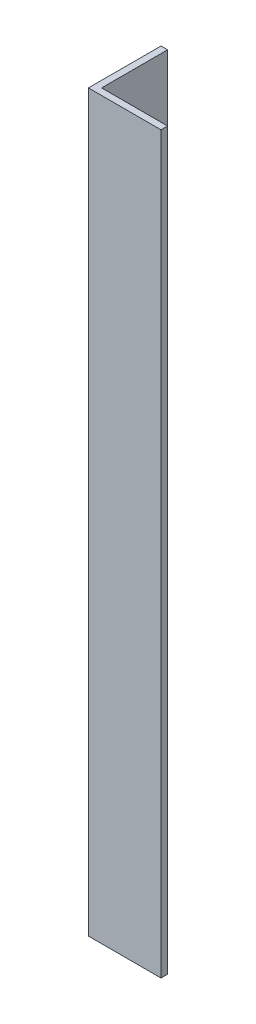
ISO-10303-21;
HEADER;
FILE_DESCRIPTION(('STEP AP214'),'2;1');
FILE_NAME('part.step','',(''),(''),'','','');
FILE_SCHEMA(('AUTOMOTIVE_DESIGN { 1 0 10303 214 1 1 1 1 }'));
ENDSEC;
DATA;
#1=APPLICATION_CONTEXT('core data for automotive mechanical design processes');
#2=APPLICATION_PROTOCOL_DEFINITION('international standard','automotive_design',2000,#1);
#3=PRODUCT_CONTEXT('',#1,'mechanical');
#4=PRODUCT('Part','Part','',(#3));
#5=PRODUCT_RELATED_PRODUCT_CATEGORY('part','',(#4));
#6=PRODUCT_DEFINITION_FORMATION('','',#4);
#7=PRODUCT_DEFINITION_CONTEXT('part definition',#1,'design');
#8=PRODUCT_DEFINITION('design','',#6,#7);
#9=PRODUCT_DEFINITION_SHAPE('','',#8);
#10=(LENGTH_UNIT() NAMED_UNIT(*) SI_UNIT(.MILLI.,.METRE.));
#11=(NAMED_UNIT(*) PLANE_ANGLE_UNIT() SI_UNIT($,.RADIAN.));
#12=(NAMED_UNIT(*) SI_UNIT($,.STERADIAN.) SOLID_ANGLE_UNIT());
#13=UNCERTAINTY_MEASURE_WITH_UNIT(LENGTH_MEASURE(1.E-05),#10,'distance_accuracy_value','');
#14=(GEOMETRIC_REPRESENTATION_CONTEXT(3) GLOBAL_UNCERTAINTY_ASSIGNED_CONTEXT((#13)) GLOBAL_UNIT_ASSIGNED_CONTEXT((#10,
#11,#12)) REPRESENTATION_CONTEXT('',''));
#15=CARTESIAN_POINT('',(0.,0.,0.));
#16=DIRECTION('',(0.,0.,1.));
#17=DIRECTION('',(1.,0.,0.));
#18=AXIS2_PLACEMENT_3D('',#15,#16,#17);
#19=CARTESIAN_POINT('',(0.,334.,0.));
#20=DIRECTION('',(0.,0.,-1.));
#21=DIRECTION('',(-1.,0.,0.));
#22=AXIS2_PLACEMENT_3D('',#19,#20,#21);
#23=PLANE('',#22);
#24=DIRECTION('',(1.,0.,0.));
#25=VECTOR('',#24,1.);
#26=CARTESIAN_POINT('',(0.,0.,0.));
#27=LINE('',#26,#25);
#28=CARTESIAN_POINT('',(0.,0.,0.));
#29=VERTEX_POINT('',#28);
#30=CARTESIAN_POINT('',(33.,0.,0.));
#31=VERTEX_POINT('',#30);
#32=EDGE_CURVE('E115',#29,#31,#27,.T.);
#33=ORIENTED_EDGE('',*,*,#32,.T.);
#34=DIRECTION('',(0.,-1.,0.));
#35=VECTOR('',#34,1.);
#36=CARTESIAN_POINT('',(33.,334.,0.));
#37=LINE('',#36,#35);
#38=CARTESIAN_POINT('',(33.,334.,0.));
#39=VERTEX_POINT('',#38);
#40=EDGE_CURVE('E11',#39,#31,#37,.T.);
#41=ORIENTED_EDGE('',*,*,#40,.F.);
#42=DIRECTION('',(1.,0.,0.));
#43=VECTOR('',#42,1.);
#44=CARTESIAN_POINT('',(0.,334.,0.));
#45=LINE('',#44,#43);
#46=CARTESIAN_POINT('',(0.,334.,0.));
#47=VERTEX_POINT('',#46);
#48=EDGE_CURVE('E80',#47,#39,#45,.T.);
#49=ORIENTED_EDGE('',*,*,#48,.F.);
#50=DIRECTION('',(0.,-1.,0.));
#51=VECTOR('',#50,1.);
#52=CARTESIAN_POINT('',(0.,334.,0.));
#53=LINE('',#52,#51);
#54=EDGE_CURVE('E111',#47,#29,#53,.T.);
#55=ORIENTED_EDGE('',*,*,#54,.T.);
#56=EDGE_LOOP('',(#33,#41,#49,#55));
#57=FACE_BOUND('',#56,.T.);
#58=ADVANCED_FACE('F34',(#57),#23,.F.);
#59=CARTESIAN_POINT('',(33.,334.,-3.));
#60=DIRECTION('',(1.,0.,0.));
#61=DIRECTION('',(0.,0.,-1.));
#62=AXIS2_PLACEMENT_3D('',#59,#60,#61);
#63=PLANE('',#62);
#64=DIRECTION('',(0.,0.,1.));
#65=VECTOR('',#64,1.);
#66=CARTESIAN_POINT('',(33.,0.,-3.));
#67=LINE('',#66,#65);
#68=CARTESIAN_POINT('',(33.,0.,-3.));
#69=VERTEX_POINT('',#68);
#70=EDGE_CURVE('E118',#69,#31,#67,.T.);
#71=ORIENTED_EDGE('',*,*,#70,.F.);
#72=DIRECTION('',(0.,-1.,0.));
#73=VECTOR('',#72,1.);
#74=CARTESIAN_POINT('',(33.,334.,-3.));
#75=LINE('',#74,#73);
#76=CARTESIAN_POINT('',(33.,334.,-3.));
#77=VERTEX_POINT('',#76);
#78=EDGE_CURVE('E42',#77,#69,#75,.T.);
#79=ORIENTED_EDGE('',*,*,#78,.F.);
#80=DIRECTION('',(0.,0.,1.));
#81=VECTOR('',#80,1.);
#82=CARTESIAN_POINT('',(33.,334.,-3.));
#83=LINE('',#82,#81);
#84=EDGE_CURVE('E204',#77,#39,#83,.T.);
#85=ORIENTED_EDGE('',*,*,#84,.T.);
#86=ORIENTED_EDGE('',*,*,#40,.T.);
#87=EDGE_LOOP('',(#71,#79,#85,#86));
#88=FACE_BOUND('',#87,.T.);
#89=ADVANCED_FACE('F136',(#88),#63,.T.);
#90=CARTESIAN_POINT('',(0.,334.,-3.));
#91=DIRECTION('',(0.,0.,-1.));
#92=DIRECTION('',(-1.,0.,0.));
#93=AXIS2_PLACEMENT_3D('',#90,#91,#92);
#94=PLANE('',#93);
#95=DIRECTION('',(1.,0.,0.));
#96=VECTOR('',#95,1.);
#97=CARTESIAN_POINT('',(0.,0.,-3.));
#98=LINE('',#97,#96);
#99=CARTESIAN_POINT('',(3.,0.,-3.));
#100=VERTEX_POINT('',#99);
#101=EDGE_CURVE('E121',#100,#69,#98,.T.);
#102=ORIENTED_EDGE('',*,*,#101,.F.);
#103=DIRECTION('',(0.,-1.,0.));
#104=VECTOR('',#103,1.);
#105=CARTESIAN_POINT('',(3.,334.,-3.));
#106=LINE('',#105,#104);
#107=CARTESIAN_POINT('',(3.,334.,-3.));
#108=VERTEX_POINT('',#107);
#109=EDGE_CURVE('E101',#108,#100,#106,.T.);
#110=ORIENTED_EDGE('',*,*,#109,.F.);
#111=DIRECTION('',(1.,0.,0.));
#112=VECTOR('',#111,1.);
#113=CARTESIAN_POINT('',(0.,334.,-3.));
#114=LINE('',#113,#112);
#115=EDGE_CURVE('E107',#108,#77,#114,.T.);
#116=ORIENTED_EDGE('',*,*,#115,.T.);
#117=ORIENTED_EDGE('',*,*,#78,.T.);
#118=EDGE_LOOP('',(#102,#110,#116,#117));
#119=FACE_BOUND('',#118,.T.);
#120=ADVANCED_FACE('F133',(#119),#94,.T.);
#121=CARTESIAN_POINT('',(3.,334.,-33.));
#122=DIRECTION('',(1.,0.,0.));
#123=DIRECTION('',(0.,0.,-1.));
#124=AXIS2_PLACEMENT_3D('',#121,#122,#123);
#125=PLANE('',#124);
#126=DIRECTION('',(0.,0.,1.));
#127=VECTOR('',#126,1.);
#128=CARTESIAN_POINT('',(3.,0.,-33.));
#129=LINE('',#128,#127);
#130=CARTESIAN_POINT('',(3.,0.,-33.));
#131=VERTEX_POINT('',#130);
#132=EDGE_CURVE('E96',#131,#100,#129,.T.);
#133=ORIENTED_EDGE('',*,*,#132,.F.);
#134=DIRECTION('',(0.,-1.,0.));
#135=VECTOR('',#134,1.);
#136=CARTESIAN_POINT('',(3.,334.,-33.));
#137=LINE('',#136,#135);
#138=CARTESIAN_POINT('',(3.,334.,-33.));
#139=VERTEX_POINT('',#138);
#140=EDGE_CURVE('E91',#139,#131,#137,.T.);
#141=ORIENTED_EDGE('',*,*,#140,.F.);
#142=DIRECTION('',(0.,0.,1.));
#143=VECTOR('',#142,1.);
#144=CARTESIAN_POINT('',(3.,334.,-33.));
#145=LINE('',#144,#143);
#146=EDGE_CURVE('E94',#139,#108,#145,.T.);
#147=ORIENTED_EDGE('',*,*,#146,.T.);
#148=ORIENTED_EDGE('',*,*,#109,.T.);
#149=EDGE_LOOP('',(#133,#141,#147,#148));
#150=FACE_BOUND('',#149,.T.);
#151=ADVANCED_FACE('F93',(#150),#125,.T.);
#152=CARTESIAN_POINT('',(0.,334.,-33.));
#153=DIRECTION('',(0.,0.,-1.));
#154=DIRECTION('',(-1.,0.,0.));
#155=AXIS2_PLACEMENT_3D('',#152,#153,#154);
#156=PLANE('',#155);
#157=DIRECTION('',(1.,0.,0.));
#158=VECTOR('',#157,1.);
#159=CARTESIAN_POINT('',(0.,0.,-33.));
#160=LINE('',#159,#158);
#161=CARTESIAN_POINT('',(0.,0.,-33.));
#162=VERTEX_POINT('',#161);
#163=EDGE_CURVE('E125',#162,#131,#160,.T.);
#164=ORIENTED_EDGE('',*,*,#163,.F.);
#165=DIRECTION('',(0.,-1.,0.));
#166=VECTOR('',#165,1.);
#167=CARTESIAN_POINT('',(0.,334.,-33.));
#168=LINE('',#167,#166);
#169=CARTESIAN_POINT('',(0.,334.,-33.));
#170=VERTEX_POINT('',#169);
#171=EDGE_CURVE('E71',#170,#162,#168,.T.);
#172=ORIENTED_EDGE('',*,*,#171,.F.);
#173=DIRECTION('',(1.,0.,0.));
#174=VECTOR('',#173,1.);
#175=CARTESIAN_POINT('',(0.,334.,-33.));
#176=LINE('',#175,#174);
#177=EDGE_CURVE('E105',#170,#139,#176,.T.);
#178=ORIENTED_EDGE('',*,*,#177,.T.);
#179=ORIENTED_EDGE('',*,*,#140,.T.);
#180=EDGE_LOOP('',(#164,#172,#178,#179));
#181=FACE_BOUND('',#180,.T.);
#182=ADVANCED_FACE('F109',(#181),#156,.T.);
#183=CARTESIAN_POINT('',(0.,334.,-33.));
#184=DIRECTION('',(1.,0.,0.));
#185=DIRECTION('',(0.,0.,-1.));
#186=AXIS2_PLACEMENT_3D('',#183,#184,#185);
#187=PLANE('',#186);
#188=DIRECTION('',(0.,0.,1.));
#189=VECTOR('',#188,1.);
#190=CARTESIAN_POINT('',(0.,0.,-33.));
#191=LINE('',#190,#189);
#192=EDGE_CURVE('E74',#162,#29,#191,.T.);
#193=ORIENTED_EDGE('',*,*,#192,.T.);
#194=ORIENTED_EDGE('',*,*,#54,.F.);
#195=DIRECTION('',(0.,0.,1.));
#196=VECTOR('',#195,1.);
#197=CARTESIAN_POINT('',(0.,334.,-33.));
#198=LINE('',#197,#196);
#199=EDGE_CURVE('E50',#170,#47,#198,.T.);
#200=ORIENTED_EDGE('',*,*,#199,.F.);
#201=ORIENTED_EDGE('',*,*,#171,.T.);
#202=EDGE_LOOP('',(#193,#194,#200,#201));
#203=FACE_BOUND('',#202,.T.);
#204=ADVANCED_FACE('F141',(#203),#187,.F.);
#205=CARTESIAN_POINT('',(0.,334.,0.));
#206=DIRECTION('',(0.,-1.,0.));
#207=DIRECTION('',(-1.,0.,0.));
#208=AXIS2_PLACEMENT_3D('',#205,#206,#207);
#209=PLANE('',#208);
#210=ORIENTED_EDGE('',*,*,#48,.T.);
#211=ORIENTED_EDGE('',*,*,#84,.F.);
#212=ORIENTED_EDGE('',*,*,#115,.F.);
#213=ORIENTED_EDGE('',*,*,#146,.F.);
#214=ORIENTED_EDGE('',*,*,#177,.F.);
#215=ORIENTED_EDGE('',*,*,#199,.T.);
#216=EDGE_LOOP('',(#210,#211,#212,#213,#214,#215));
#217=FACE_BOUND('',#216,.T.);
#218=ADVANCED_FACE('F104',(#217),#209,.F.);
#219=CARTESIAN_POINT('',(0.,0.,0.));
#220=DIRECTION('',(0.,-1.,0.));
#221=DIRECTION('',(-1.,0.,0.));
#222=AXIS2_PLACEMENT_3D('',#219,#220,#221);
#223=PLANE('',#222);
#224=ORIENTED_EDGE('',*,*,#32,.F.);
#225=ORIENTED_EDGE('',*,*,#192,.F.);
#226=ORIENTED_EDGE('',*,*,#163,.T.);
#227=ORIENTED_EDGE('',*,*,#132,.T.);
#228=ORIENTED_EDGE('',*,*,#101,.T.);
#229=ORIENTED_EDGE('',*,*,#70,.T.);
#230=EDGE_LOOP('',(#224,#225,#226,#227,#228,#229));
#231=FACE_BOUND('',#230,.T.);
#232=ADVANCED_FACE('F139',(#231),#223,.T.);
#233=CLOSED_SHELL('',(#58,#89,#120,#151,#182,#204,#218,#232));
#234=MANIFOLD_SOLID_BREP('B2',#233);
#235=ADVANCED_BREP_SHAPE_REPRESENTATION('',(#18,#234),#14);
#236=SHAPE_DEFINITION_REPRESENTATION(#9,#235);
ENDSEC;
END-ISO-10303-21;
